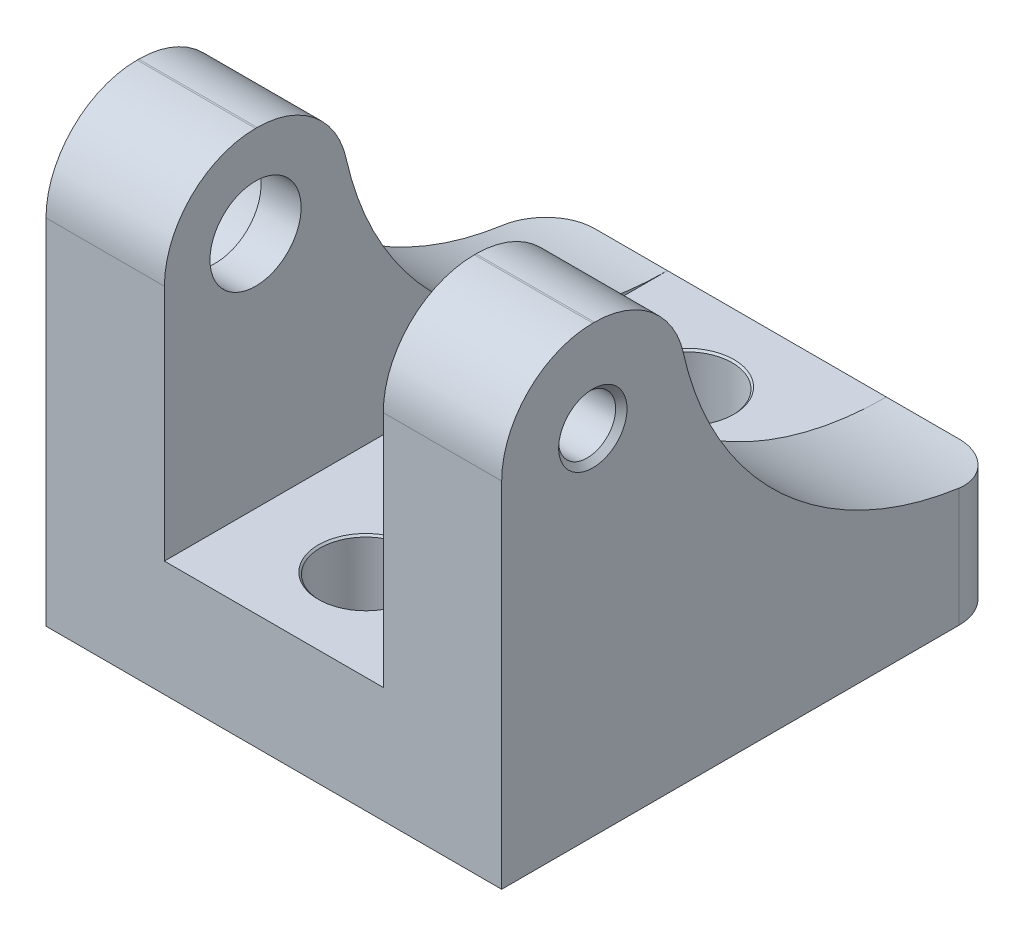
ISO-10303-21;
HEADER;
FILE_DESCRIPTION(('STEP AP214'),'2;1');
FILE_NAME('part.step','',(''),(''),'','','');
FILE_SCHEMA(('AUTOMOTIVE_DESIGN { 1 0 10303 214 1 1 1 1 }'));
ENDSEC;
DATA;
#1=APPLICATION_CONTEXT('core data for automotive mechanical design processes');
#2=APPLICATION_PROTOCOL_DEFINITION('international standard','automotive_design',2000,#1);
#3=PRODUCT_CONTEXT('',#1,'mechanical');
#4=PRODUCT('Part','Part','',(#3));
#5=PRODUCT_RELATED_PRODUCT_CATEGORY('part','',(#4));
#6=PRODUCT_DEFINITION_FORMATION('','',#4);
#7=PRODUCT_DEFINITION_CONTEXT('part definition',#1,'design');
#8=PRODUCT_DEFINITION('design','',#6,#7);
#9=PRODUCT_DEFINITION_SHAPE('','',#8);
#10=(LENGTH_UNIT() NAMED_UNIT(*) SI_UNIT(.MILLI.,.METRE.));
#11=(NAMED_UNIT(*) PLANE_ANGLE_UNIT() SI_UNIT($,.RADIAN.));
#12=(NAMED_UNIT(*) SI_UNIT($,.STERADIAN.) SOLID_ANGLE_UNIT());
#13=UNCERTAINTY_MEASURE_WITH_UNIT(LENGTH_MEASURE(1.E-05),#10,'distance_accuracy_value','');
#14=(GEOMETRIC_REPRESENTATION_CONTEXT(3) GLOBAL_UNCERTAINTY_ASSIGNED_CONTEXT((#13)) GLOBAL_UNIT_ASSIGNED_CONTEXT((#10,
#11,#12)) REPRESENTATION_CONTEXT('',''));
#15=CARTESIAN_POINT('',(0.,0.,0.));
#16=DIRECTION('',(0.,0.,1.));
#17=DIRECTION('',(1.,0.,0.));
#18=AXIS2_PLACEMENT_3D('',#15,#16,#17);
#19=CARTESIAN_POINT('',(0.,61.976,0.));
#20=DIRECTION('',(0.,-1.,0.));
#21=DIRECTION('',(0.,0.,-1.));
#22=AXIS2_PLACEMENT_3D('',#19,#20,#21);
#23=PLANE('',#22);
#24=DIRECTION('',(1.,0.,0.));
#25=VECTOR('',#24,1.);
#26=CARTESIAN_POINT('',(0.,61.976,-12.9316840832639));
#27=LINE('',#26,#25);
#28=CARTESIAN_POINT('',(63.5,61.976,-12.9316840832639));
#29=VERTEX_POINT('',#28);
#30=CARTESIAN_POINT('',(47.,61.976,-12.9316840832639));
#31=VERTEX_POINT('',#30);
#32=EDGE_CURVE('E352',#29,#31,#27,.F.);
#33=ORIENTED_EDGE('',*,*,#32,.T.);
#34=DIRECTION('',(0.,0.,1.));
#35=VECTOR('',#34,1.);
#36=CARTESIAN_POINT('',(47.,61.976,-70.104));
#37=LINE('',#36,#35);
#38=CARTESIAN_POINT('',(47.,61.976,-12.7));
#39=VERTEX_POINT('',#38);
#40=EDGE_CURVE('E228',#31,#39,#37,.T.);
#41=ORIENTED_EDGE('',*,*,#40,.T.);
#42=DIRECTION('',(1.,0.,0.));
#43=VECTOR('',#42,1.);
#44=CARTESIAN_POINT('',(0.,61.976,-12.7));
#45=LINE('',#44,#43);
#46=CARTESIAN_POINT('',(63.5,61.976,-12.7));
#47=VERTEX_POINT('',#46);
#48=EDGE_CURVE('E246',#39,#47,#45,.T.);
#49=ORIENTED_EDGE('',*,*,#48,.T.);
#50=DIRECTION('',(0.,0.,-1.));
#51=VECTOR('',#50,1.);
#52=CARTESIAN_POINT('',(63.5,61.976,0.));
#53=LINE('',#52,#51);
#54=EDGE_CURVE('E367',#47,#29,#53,.T.);
#55=ORIENTED_EDGE('',*,*,#54,.T.);
#56=EDGE_LOOP('',(#33,#41,#49,#55));
#57=FACE_BOUND('',#56,.T.);
#58=ADVANCED_FACE('F35',(#57),#23,.F.);
#59=CARTESIAN_POINT('',(0.,61.976,-70.104));
#60=DIRECTION('',(1.,0.,0.));
#61=DIRECTION('',(0.,0.,-1.));
#62=AXIS2_PLACEMENT_3D('',#59,#60,#61);
#63=CYLINDRICAL_SURFACE('',#62,45.8658920130401);
#64=DIRECTION('',(1.,0.,0.));
#65=VECTOR('',#64,1.);
#66=CARTESIAN_POINT('',(0.,16.1101079869599,-70.104));
#67=LINE('',#66,#65);
#68=CARTESIAN_POINT('',(47.,16.1101079869599,-70.104));
#69=VERTEX_POINT('',#68);
#70=CARTESIAN_POINT('',(57.15,16.1101079869599,-70.104));
#71=VERTEX_POINT('',#70);
#72=EDGE_CURVE('E60',#69,#71,#67,.T.);
#73=ORIENTED_EDGE('',*,*,#72,.F.);
#74=CARTESIAN_POINT('',(47.,61.976,-70.104));
#75=DIRECTION('',(1.,0.,0.));
#76=DIRECTION('',(0.,0.,-1.));
#77=AXIS2_PLACEMENT_3D('',#74,#75,#76);
#78=CIRCLE('',#77,45.8658920130401);
#79=CARTESIAN_POINT('',(47.,52.0299920328386,-25.3294874323682));
#80=VERTEX_POINT('',#79);
#81=EDGE_CURVE('E219',#69,#80,#78,.F.);
#82=ORIENTED_EDGE('',*,*,#81,.T.);
#83=DIRECTION('',(1.,0.,0.));
#84=VECTOR('',#83,1.);
#85=CARTESIAN_POINT('',(0.,52.0299920328386,-25.3294874323682));
#86=LINE('',#85,#84);
#87=CARTESIAN_POINT('',(63.5,52.0299920328386,-25.3294874323682));
#88=VERTEX_POINT('',#87);
#89=EDGE_CURVE('E362',#80,#88,#86,.T.);
#90=ORIENTED_EDGE('',*,*,#89,.T.);
#91=CARTESIAN_POINT('',(63.5,61.976,-70.104));
#92=DIRECTION('',(1.,0.,0.));
#93=DIRECTION('',(0.,0.,-1.));
#94=AXIS2_PLACEMENT_3D('',#91,#92,#93);
#95=CIRCLE('',#94,45.8658920130401);
#96=CARTESIAN_POINT('',(63.5,16.5518043532761,-63.754));
#97=VERTEX_POINT('',#96);
#98=EDGE_CURVE('E188',#88,#97,#95,.T.);
#99=ORIENTED_EDGE('',*,*,#98,.T.);
#100=CARTESIAN_POINT('',(63.5,16.5518043532761,-63.754));
#101=CARTESIAN_POINT('',(63.5000196025609,16.5270901487558,-63.9307165444268));
#102=CARTESIAN_POINT('',(63.4926238054073,16.5034268505947,-64.1075830488763));
#103=CARTESIAN_POINT('',(63.4630671968562,16.4583025677582,-64.4603628241222));
#104=CARTESIAN_POINT('',(63.4409061783909,16.4368416139733,-64.6362760815154));
#105=CARTESIAN_POINT('',(63.3819031150375,16.3962357443872,-64.9857833763753));
#106=CARTESIAN_POINT('',(63.3450701325067,16.3770894084255,-65.1593787772217));
#107=CARTESIAN_POINT('',(63.2569329279387,16.3411274965883,-65.5030975186416));
#108=CARTESIAN_POINT('',(63.2056291688241,16.3243118461794,-65.6732209700965));
#109=CARTESIAN_POINT('',(63.0888290420714,16.292979818058,-66.0088624311424));
#110=CARTESIAN_POINT('',(63.0233238728435,16.2784648759537,-66.1743775125002));
#111=CARTESIAN_POINT('',(62.878544882949,16.2516684250706,-66.499533963454));
#112=CARTESIAN_POINT('',(62.7992659818956,16.2393877438238,-66.6591731393231));
#113=CARTESIAN_POINT('',(62.627538892471,16.2169520177526,-66.9712621028462));
#114=CARTESIAN_POINT('',(62.5350968944456,16.206795979263,-67.1237152253546));
#115=CARTESIAN_POINT('',(62.3376596555954,16.1884427709255,-67.4203929982001));
#116=CARTESIAN_POINT('',(62.2326641605881,16.1802456407516,-67.5646174818366));
#117=CARTESIAN_POINT('',(62.0114221735617,16.1656560212587,-67.8430754093447));
#118=CARTESIAN_POINT('',(61.8952347984165,16.1592546804816,-67.9773553674312));
#119=CARTESIAN_POINT('',(61.6519899693174,16.1479909369384,-68.2357485432069));
#120=CARTESIAN_POINT('',(61.5249325483114,16.1431285295079,-68.3598617917099));
#121=CARTESIAN_POINT('',(61.2608140495119,16.134716525913,-68.5970590291766));
#122=CARTESIAN_POINT('',(61.1237505776319,16.1311672451733,-68.710140363381));
#123=CARTESIAN_POINT('',(60.8406192876178,16.1251531272757,-68.9244303576798));
#124=CARTESIAN_POINT('',(60.6945516240537,16.122688271508,-69.0256392214959));
#125=CARTESIAN_POINT('',(60.394063964283,16.1186118648673,-69.2157059508047));
#126=CARTESIAN_POINT('',(60.2396239143337,16.1170024724125,-69.3045321614144));
#127=CARTESIAN_POINT('',(59.92388314051,16.1144320608181,-69.468869962778));
#128=CARTESIAN_POINT('',(59.7625849016851,16.1134708089191,-69.544386326144));
#129=CARTESIAN_POINT('',(59.4342489934345,16.112001762078,-69.681592075002));
#130=CARTESIAN_POINT('',(59.2672127674326,16.1114938539495,-69.7432849089293));
#131=CARTESIAN_POINT('',(58.928615885181,16.1107656540308,-69.8524162414465));
#132=CARTESIAN_POINT('',(58.7570562542225,16.1105452976252,-69.8998579405451));
#133=CARTESIAN_POINT('',(58.3488043963675,16.1102056488348,-69.9944697175828));
#134=CARTESIAN_POINT('',(58.1106543511925,16.1101502016966,-70.035538529829));
#135=CARTESIAN_POINT('',(57.7513852036139,16.1101144761882,-70.0766087416445));
#136=CARTESIAN_POINT('',(57.6313422431885,16.110110466428,-70.0868766356861));
#137=CARTESIAN_POINT('',(57.3908767594374,16.1101078097517,-70.1005712905643));
#138=CARTESIAN_POINT('',(57.2704542687353,16.1101091623866,-70.103998624157));
#139=CARTESIAN_POINT('',(57.15,16.1101079869599,-70.104));
#140=B_SPLINE_CURVE_WITH_KNOTS('',3,(#100,#101,#102,#103,#104,#105,#106,#107,#108,#109,#110,
#111,#112,#113,#114,#115,#116,#117,#118,#119,#120,#121,#122,#123,#124,#125,#126,#127,#128,#129,
#130,#131,#132,#133,#134,#135,#136,#137,#138,#139),.UNSPECIFIED.,.F.,.F.,(4,2,2,2,2,2,2,2,2,2,2,
2,2,2,2,2,2,2,2,4),(0.,0.535157201483708,1.07032190818259,1.60515657371647,2.13997413173911,
2.67512410538596,3.21047188768451,3.74556873288179,4.28067641453154,4.81309824959147,
5.34551847089816,5.87806650130234,6.41060539229192,6.94448162891428,7.4781660383158,
8.011717165533,8.54514837851854,9.26835569273905,9.62963658731783,9.99088723078644),.UNSPECIFIED.);
#141=EDGE_CURVE('E11',#97,#71,#140,.T.);
#142=ORIENTED_EDGE('',*,*,#141,.T.);
#143=EDGE_LOOP('',(#73,#82,#90,#99,#142));
#144=FACE_BOUND('',#143,.T.);
#145=ADVANCED_FACE('F294',(#144),#63,.F.);
#146=CARTESIAN_POINT('',(0.,49.276,-12.9316840832639));
#147=DIRECTION('',(1.,0.,0.));
#148=DIRECTION('',(0.,0.,-1.));
#149=AXIS2_PLACEMENT_3D('',#146,#147,#148);
#150=CYLINDRICAL_SURFACE('',#149,12.7);
#151=CARTESIAN_POINT('',(47.,49.276,-12.9316840832639));
#152=DIRECTION('',(1.,0.,0.));
#153=DIRECTION('',(0.,0.,-1.));
#154=AXIS2_PLACEMENT_3D('',#151,#152,#153);
#155=CIRCLE('',#154,12.7);
#156=EDGE_CURVE('E222',#31,#80,#155,.F.);
#157=ORIENTED_EDGE('',*,*,#156,.F.);
#158=ORIENTED_EDGE('',*,*,#32,.F.);
#159=CARTESIAN_POINT('',(63.5,49.276,-12.9316840832639));
#160=DIRECTION('',(-1.,0.,0.));
#161=DIRECTION('',(0.,0.,1.));
#162=AXIS2_PLACEMENT_3D('',#159,#160,#161);
#163=CIRCLE('',#162,12.7);
#164=EDGE_CURVE('E257',#88,#29,#163,.F.);
#165=ORIENTED_EDGE('',*,*,#164,.F.);
#166=ORIENTED_EDGE('',*,*,#89,.F.);
#167=EDGE_LOOP('',(#157,#158,#165,#166));
#168=FACE_BOUND('',#167,.T.);
#169=ADVANCED_FACE('F327',(#168),#150,.T.);
#170=CARTESIAN_POINT('',(0.,49.276,-12.7));
#171=DIRECTION('',(1.,0.,0.));
#172=DIRECTION('',(0.,0.,-1.));
#173=AXIS2_PLACEMENT_3D('',#170,#171,#172);
#174=CYLINDRICAL_SURFACE('',#173,12.7);
#175=CARTESIAN_POINT('',(47.,49.276,-12.7));
#176=DIRECTION('',(1.,0.,0.));
#177=DIRECTION('',(0.,0.,-1.));
#178=AXIS2_PLACEMENT_3D('',#175,#176,#177);
#179=CIRCLE('',#178,12.7);
#180=CARTESIAN_POINT('',(47.,49.276,0.));
#181=VERTEX_POINT('',#180);
#182=EDGE_CURVE('E224',#181,#39,#179,.F.);
#183=ORIENTED_EDGE('',*,*,#182,.F.);
#184=DIRECTION('',(1.,0.,0.));
#185=VECTOR('',#184,1.);
#186=CARTESIAN_POINT('',(0.,49.276,0.));
#187=LINE('',#186,#185);
#188=CARTESIAN_POINT('',(63.5,49.276,0.));
#189=VERTEX_POINT('',#188);
#190=EDGE_CURVE('E245',#189,#181,#187,.F.);
#191=ORIENTED_EDGE('',*,*,#190,.F.);
#192=CARTESIAN_POINT('',(63.5,49.276,-12.7));
#193=DIRECTION('',(-1.,0.,0.));
#194=DIRECTION('',(0.,0.,1.));
#195=AXIS2_PLACEMENT_3D('',#192,#193,#194);
#196=CIRCLE('',#195,12.7);
#197=EDGE_CURVE('E363',#47,#189,#196,.F.);
#198=ORIENTED_EDGE('',*,*,#197,.F.);
#199=ORIENTED_EDGE('',*,*,#48,.F.);
#200=EDGE_LOOP('',(#183,#191,#198,#199));
#201=FACE_BOUND('',#200,.T.);
#202=ADVANCED_FACE('F243',(#201),#174,.T.);
#203=CARTESIAN_POINT('',(0.,61.976,0.));
#204=DIRECTION('',(1.,0.,0.));
#205=DIRECTION('',(0.,0.,-1.));
#206=AXIS2_PLACEMENT_3D('',#203,#204,#205);
#207=PLANE('',#206);
#208=CARTESIAN_POINT('',(0.,49.276,-12.7));
#209=DIRECTION('',(-1.,0.,0.));
#210=DIRECTION('',(0.,0.,1.));
#211=AXIS2_PLACEMENT_3D('',#208,#209,#210);
#212=CIRCLE('',#211,10.414);
#213=CARTESIAN_POINT('',(0.,49.276,-2.286));
#214=VERTEX_POINT('',#213);
#215=EDGE_CURVE('E203',#214,#214,#212,.T.);
#216=ORIENTED_EDGE('',*,*,#215,.F.);
#217=EDGE_LOOP('',(#216));
#218=FACE_BOUND('',#217,.T.);
#219=CARTESIAN_POINT('',(0.,61.976,-70.104));
#220=DIRECTION('',(1.,0.,0.));
#221=DIRECTION('',(0.,0.,-1.));
#222=AXIS2_PLACEMENT_3D('',#219,#220,#221);
#223=CIRCLE('',#222,45.8658920130401);
#224=CARTESIAN_POINT('',(0.,52.0299920328386,-25.3294874323682));
#225=VERTEX_POINT('',#224);
#226=CARTESIAN_POINT('',(0.,16.5518043532761,-63.754));
#227=VERTEX_POINT('',#226);
#228=EDGE_CURVE('E186',#225,#227,#223,.T.);
#229=ORIENTED_EDGE('',*,*,#228,.T.);
#230=DIRECTION('',(0.,-1.,0.));
#231=VECTOR('',#230,1.);
#232=CARTESIAN_POINT('',(0.,61.976,-63.754));
#233=LINE('',#232,#231);
#234=CARTESIAN_POINT('',(0.,0.,-63.754));
#235=VERTEX_POINT('',#234);
#236=EDGE_CURVE('E269',#227,#235,#233,.T.);
#237=ORIENTED_EDGE('',*,*,#236,.T.);
#238=DIRECTION('',(0.,0.,1.));
#239=VECTOR('',#238,1.);
#240=CARTESIAN_POINT('',(0.,0.,0.));
#241=LINE('',#240,#239);
#242=CARTESIAN_POINT('',(0.,0.,0.));
#243=VERTEX_POINT('',#242);
#244=EDGE_CURVE('E181',#235,#243,#241,.T.);
#245=ORIENTED_EDGE('',*,*,#244,.T.);
#246=DIRECTION('',(0.,-1.,0.));
#247=VECTOR('',#246,1.);
#248=CARTESIAN_POINT('',(0.,61.976,0.));
#249=LINE('',#248,#247);
#250=CARTESIAN_POINT('',(0.,49.276,0.));
#251=VERTEX_POINT('',#250);
#252=EDGE_CURVE('E354',#251,#243,#249,.T.);
#253=ORIENTED_EDGE('',*,*,#252,.F.);
#254=CARTESIAN_POINT('',(0.,49.276,-12.7));
#255=DIRECTION('',(1.,0.,0.));
#256=DIRECTION('',(0.,0.,-1.));
#257=AXIS2_PLACEMENT_3D('',#254,#255,#256);
#258=CIRCLE('',#257,12.7);
#259=CARTESIAN_POINT('',(0.,61.976,-12.7));
#260=VERTEX_POINT('',#259);
#261=EDGE_CURVE('E358',#251,#260,#258,.F.);
#262=ORIENTED_EDGE('',*,*,#261,.T.);
#263=DIRECTION('',(0.,0.,1.));
#264=VECTOR('',#263,1.);
#265=CARTESIAN_POINT('',(0.,61.976,0.));
#266=LINE('',#265,#264);
#267=CARTESIAN_POINT('',(0.,61.976,-12.9316840832639));
#268=VERTEX_POINT('',#267);
#269=EDGE_CURVE('E346',#268,#260,#266,.T.);
#270=ORIENTED_EDGE('',*,*,#269,.F.);
#271=CARTESIAN_POINT('',(0.,49.276,-12.9316840832639));
#272=DIRECTION('',(1.,0.,0.));
#273=DIRECTION('',(0.,0.,-1.));
#274=AXIS2_PLACEMENT_3D('',#271,#272,#273);
#275=CIRCLE('',#274,12.7);
#276=EDGE_CURVE('E360',#268,#225,#275,.F.);
#277=ORIENTED_EDGE('',*,*,#276,.T.);
#278=EDGE_LOOP('',(#229,#237,#245,#253,#262,#270,#277));
#279=FACE_BOUND('',#278,.T.);
#280=ADVANCED_FACE('F389',(#218,#279),#207,.F.);
#281=CARTESIAN_POINT('',(0.,61.976,0.));
#282=DIRECTION('',(0.,0.,-1.));
#283=DIRECTION('',(-1.,0.,0.));
#284=AXIS2_PLACEMENT_3D('',#281,#282,#283);
#285=PLANE('',#284);
#286=ORIENTED_EDGE('',*,*,#190,.T.);
#287=DIRECTION('',(0.,1.,0.));
#288=VECTOR('',#287,1.);
#289=CARTESIAN_POINT('',(47.,16.1101079869599,0.));
#290=LINE('',#289,#288);
#291=CARTESIAN_POINT('',(47.,16.1101079869599,0.));
#292=VERTEX_POINT('',#291);
#293=EDGE_CURVE('E164',#292,#181,#290,.T.);
#294=ORIENTED_EDGE('',*,*,#293,.F.);
#295=DIRECTION('',(-1.,0.,0.));
#296=VECTOR('',#295,1.);
#297=CARTESIAN_POINT('',(46.228,16.1101079869599,0.));
#298=LINE('',#297,#296);
#299=CARTESIAN_POINT('',(16.5,16.1101079869599,0.));
#300=VERTEX_POINT('',#299);
#301=EDGE_CURVE('E193',#292,#300,#298,.T.);
#302=ORIENTED_EDGE('',*,*,#301,.T.);
#303=DIRECTION('',(0.,-1.,0.));
#304=VECTOR('',#303,1.);
#305=CARTESIAN_POINT('',(16.5,16.1101079869599,0.));
#306=LINE('',#305,#304);
#307=CARTESIAN_POINT('',(16.5,49.276,0.));
#308=VERTEX_POINT('',#307);
#309=EDGE_CURVE('E163',#308,#300,#306,.T.);
#310=ORIENTED_EDGE('',*,*,#309,.F.);
#311=EDGE_CURVE('E252',#308,#251,#187,.F.);
#312=ORIENTED_EDGE('',*,*,#311,.T.);
#313=ORIENTED_EDGE('',*,*,#252,.T.);
#314=DIRECTION('',(1.,0.,0.));
#315=VECTOR('',#314,1.);
#316=CARTESIAN_POINT('',(0.,0.,0.));
#317=LINE('',#316,#315);
#318=CARTESIAN_POINT('',(63.5,0.,0.));
#319=VERTEX_POINT('',#318);
#320=EDGE_CURVE('E182',#243,#319,#317,.T.);
#321=ORIENTED_EDGE('',*,*,#320,.T.);
#322=DIRECTION('',(0.,-1.,0.));
#323=VECTOR('',#322,1.);
#324=CARTESIAN_POINT('',(63.5,61.976,0.));
#325=LINE('',#324,#323);
#326=EDGE_CURVE('E250',#189,#319,#325,.T.);
#327=ORIENTED_EDGE('',*,*,#326,.F.);
#328=EDGE_LOOP('',(#286,#294,#302,#310,#312,#313,#321,#327));
#329=FACE_BOUND('',#328,.T.);
#330=ADVANCED_FACE('F248',(#329),#285,.F.);
#331=CARTESIAN_POINT('',(63.5,61.976,0.));
#332=DIRECTION('',(-1.,0.,0.));
#333=DIRECTION('',(0.,0.,1.));
#334=AXIS2_PLACEMENT_3D('',#331,#332,#333);
#335=PLANE('',#334);
#336=CARTESIAN_POINT('',(63.5,49.276,-12.7));
#337=DIRECTION('',(1.,0.,0.));
#338=DIRECTION('',(0.,0.,-1.));
#339=AXIS2_PLACEMENT_3D('',#336,#337,#338);
#340=CIRCLE('',#339,4.7625);
#341=CARTESIAN_POINT('',(63.5,49.276,-17.4625));
#342=VERTEX_POINT('',#341);
#343=EDGE_CURVE('E174',#342,#342,#340,.T.);
#344=ORIENTED_EDGE('',*,*,#343,.F.);
#345=EDGE_LOOP('',(#344));
#346=FACE_BOUND('',#345,.T.);
#347=DIRECTION('',(0.,0.,-1.));
#348=VECTOR('',#347,1.);
#349=CARTESIAN_POINT('',(63.5,0.,0.));
#350=LINE('',#349,#348);
#351=CARTESIAN_POINT('',(63.5,0.,-63.754));
#352=VERTEX_POINT('',#351);
#353=EDGE_CURVE('E381',#319,#352,#350,.T.);
#354=ORIENTED_EDGE('',*,*,#353,.T.);
#355=DIRECTION('',(0.,-1.,0.));
#356=VECTOR('',#355,1.);
#357=CARTESIAN_POINT('',(63.5,61.976,-63.754));
#358=LINE('',#357,#356);
#359=EDGE_CURVE('E45',#352,#97,#358,.F.);
#360=ORIENTED_EDGE('',*,*,#359,.T.);
#361=ORIENTED_EDGE('',*,*,#98,.F.);
#362=ORIENTED_EDGE('',*,*,#164,.T.);
#363=ORIENTED_EDGE('',*,*,#54,.F.);
#364=ORIENTED_EDGE('',*,*,#197,.T.);
#365=ORIENTED_EDGE('',*,*,#326,.T.);
#366=EDGE_LOOP('',(#354,#360,#361,#362,#363,#364,#365));
#367=FACE_BOUND('',#366,.T.);
#368=ADVANCED_FACE('F337',(#346,#367),#335,.F.);
#369=CARTESIAN_POINT('',(0.,61.976,-70.104));
#370=DIRECTION('',(0.,0.,1.));
#371=DIRECTION('',(1.,0.,0.));
#372=AXIS2_PLACEMENT_3D('',#369,#370,#371);
#373=PLANE('',#372);
#374=DIRECTION('',(-1.,0.,0.));
#375=VECTOR('',#374,1.);
#376=CARTESIAN_POINT('',(0.,0.,-70.104));
#377=LINE('',#376,#375);
#378=CARTESIAN_POINT('',(57.15,0.,-70.104));
#379=VERTEX_POINT('',#378);
#380=CARTESIAN_POINT('',(6.35,0.,-70.104));
#381=VERTEX_POINT('',#380);
#382=EDGE_CURVE('E377',#379,#381,#377,.T.);
#383=ORIENTED_EDGE('',*,*,#382,.T.);
#384=DIRECTION('',(0.,-1.,0.));
#385=VECTOR('',#384,1.);
#386=CARTESIAN_POINT('',(6.35,61.976,-70.104));
#387=LINE('',#386,#385);
#388=CARTESIAN_POINT('',(6.35,16.1101079869599,-70.104));
#389=VERTEX_POINT('',#388);
#390=EDGE_CURVE('E180',#381,#389,#387,.F.);
#391=ORIENTED_EDGE('',*,*,#390,.T.);
#392=CARTESIAN_POINT('',(16.5,16.1101079869599,-70.104));
#393=VERTEX_POINT('',#392);
#394=EDGE_CURVE('E154',#389,#393,#67,.T.);
#395=ORIENTED_EDGE('',*,*,#394,.T.);
#396=EDGE_CURVE('E147',#393,#69,#67,.T.);
#397=ORIENTED_EDGE('',*,*,#396,.T.);
#398=ORIENTED_EDGE('',*,*,#72,.T.);
#399=DIRECTION('',(0.,-1.,0.));
#400=VECTOR('',#399,1.);
#401=CARTESIAN_POINT('',(57.15,61.976,-70.104));
#402=LINE('',#401,#400);
#403=EDGE_CURVE('E275',#71,#379,#402,.T.);
#404=ORIENTED_EDGE('',*,*,#403,.T.);
#405=EDGE_LOOP('',(#383,#391,#395,#397,#398,#404));
#406=FACE_BOUND('',#405,.T.);
#407=ADVANCED_FACE('F178',(#406),#373,.F.);
#408=CARTESIAN_POINT('',(16.5,61.976,-12.7));
#409=VERTEX_POINT('',#408);
#410=EDGE_CURVE('E343',#260,#409,#45,.T.);
#411=ORIENTED_EDGE('',*,*,#410,.T.);
#412=DIRECTION('',(0.,0.,1.));
#413=VECTOR('',#412,1.);
#414=CARTESIAN_POINT('',(16.5,61.976,-70.104));
#415=LINE('',#414,#413);
#416=CARTESIAN_POINT('',(16.5,61.976,-12.9316840832639));
#417=VERTEX_POINT('',#416);
#418=EDGE_CURVE('E231',#417,#409,#415,.T.);
#419=ORIENTED_EDGE('',*,*,#418,.F.);
#420=EDGE_CURVE('E350',#417,#268,#27,.F.);
#421=ORIENTED_EDGE('',*,*,#420,.T.);
#422=ORIENTED_EDGE('',*,*,#269,.T.);
#423=EDGE_LOOP('',(#411,#419,#421,#422));
#424=FACE_BOUND('',#423,.T.);
#425=ADVANCED_FACE('F296',(#424),#23,.F.);
#426=CARTESIAN_POINT('',(0.,0.,0.));
#427=DIRECTION('',(0.,-1.,0.));
#428=DIRECTION('',(0.,0.,-1.));
#429=AXIS2_PLACEMENT_3D('',#426,#427,#428);
#430=PLANE('',#429);
#431=CARTESIAN_POINT('',(31.8647521625244,0.,-12.6994815619062));
#432=DIRECTION('',(0.,1.,0.));
#433=DIRECTION('',(0.,0.,1.));
#434=AXIS2_PLACEMENT_3D('',#431,#432,#433);
#435=CIRCLE('',#434,6.35);
#436=CARTESIAN_POINT('',(31.8647521625244,0.,-6.34948156190621));
#437=VERTEX_POINT('',#436);
#438=EDGE_CURVE('E199',#437,#437,#435,.T.);
#439=ORIENTED_EDGE('',*,*,#438,.T.);
#440=EDGE_LOOP('',(#439));
#441=FACE_BOUND('',#440,.T.);
#442=CARTESIAN_POINT('',(31.8647568471166,0.,-57.404));
#443=DIRECTION('',(0.,1.,0.));
#444=DIRECTION('',(0.,0.,1.));
#445=AXIS2_PLACEMENT_3D('',#442,#443,#444);
#446=CIRCLE('',#445,6.35);
#447=CARTESIAN_POINT('',(31.8647568471166,0.,-51.054));
#448=VERTEX_POINT('',#447);
#449=EDGE_CURVE('E196',#448,#448,#446,.T.);
#450=ORIENTED_EDGE('',*,*,#449,.T.);
#451=EDGE_LOOP('',(#450));
#452=FACE_BOUND('',#451,.T.);
#453=ORIENTED_EDGE('',*,*,#244,.F.);
#454=CARTESIAN_POINT('',(6.35,0.,-63.754));
#455=DIRECTION('',(0.,-1.,0.));
#456=DIRECTION('',(0.,0.,-1.));
#457=AXIS2_PLACEMENT_3D('',#454,#455,#456);
#458=CIRCLE('',#457,6.35);
#459=EDGE_CURVE('E273',#235,#381,#458,.T.);
#460=ORIENTED_EDGE('',*,*,#459,.T.);
#461=ORIENTED_EDGE('',*,*,#382,.F.);
#462=CARTESIAN_POINT('',(57.15,0.,-63.754));
#463=DIRECTION('',(0.,-1.,0.));
#464=DIRECTION('',(0.,0.,-1.));
#465=AXIS2_PLACEMENT_3D('',#462,#463,#464);
#466=CIRCLE('',#465,6.35);
#467=EDGE_CURVE('E271',#379,#352,#466,.T.);
#468=ORIENTED_EDGE('',*,*,#467,.T.);
#469=ORIENTED_EDGE('',*,*,#353,.F.);
#470=ORIENTED_EDGE('',*,*,#320,.F.);
#471=EDGE_LOOP('',(#453,#460,#461,#468,#469,#470));
#472=FACE_BOUND('',#471,.T.);
#473=ADVANCED_FACE('F293',(#441,#452,#472),#430,.T.);
#474=CARTESIAN_POINT('',(16.5,52.0299920328386,-25.3294874323682));
#475=VERTEX_POINT('',#474);
#476=EDGE_CURVE('E173',#225,#475,#86,.T.);
#477=ORIENTED_EDGE('',*,*,#476,.T.);
#478=CARTESIAN_POINT('',(16.5,61.976,-70.104));
#479=DIRECTION('',(-1.,0.,0.));
#480=DIRECTION('',(0.,0.,1.));
#481=AXIS2_PLACEMENT_3D('',#478,#479,#480);
#482=CIRCLE('',#481,45.8658920130401);
#483=EDGE_CURVE('E160',#475,#393,#482,.F.);
#484=ORIENTED_EDGE('',*,*,#483,.T.);
#485=ORIENTED_EDGE('',*,*,#394,.F.);
#486=CARTESIAN_POINT('',(6.35,16.1101079869599,-70.104));
#487=CARTESIAN_POINT('',(6.17143340419776,16.1101158403652,-70.1040191907411));
#488=CARTESIAN_POINT('',(5.99286956029038,16.1101082335894,-70.0964686724448));
#489=CARTESIAN_POINT('',(5.63701883242709,16.1101188585174,-70.0663668126261));
#490=CARTESIAN_POINT('',(5.45973188864823,16.1101370890027,-70.0438161785434));
#491=CARTESIAN_POINT('',(5.10781647973872,16.1102560943343,-69.9838743140426));
#492=CARTESIAN_POINT('',(4.93318618684661,16.1103568095478,-69.9464938149751));
#493=CARTESIAN_POINT('',(4.58769505826889,16.1107503129259,-69.8571641154676));
#494=CARTESIAN_POINT('',(4.41683417654171,16.111043098743,-69.8052150930815));
#495=CARTESIAN_POINT('',(4.08004077664374,16.1119648015263,-69.6870971460392));
#496=CARTESIAN_POINT('',(3.91410982499498,16.1125938241536,-69.6209237553429));
#497=CARTESIAN_POINT('',(3.58835271465941,16.1143656069596,-69.4748113275943));
#498=CARTESIAN_POINT('',(3.42852882836065,16.1155085563849,-69.3948672263591));
#499=CARTESIAN_POINT('',(3.11624662406961,16.1185108497464,-69.2218325523369));
#500=CARTESIAN_POINT('',(2.96378564068105,16.1203699322188,-69.1287467854863));
#501=CARTESIAN_POINT('',(2.66725142587712,16.1250260642065,-68.9300713366135));
#502=CARTESIAN_POINT('',(2.52317835091688,16.127823131211,-68.8244814214694));
#503=CARTESIAN_POINT('',(2.24456630290562,16.1345841866162,-68.6016497101737));
#504=CARTESIAN_POINT('',(2.11001962575164,16.1385472184008,-68.4844175179612));
#505=CARTESIAN_POINT('',(1.85129105825914,16.1478735779224,-68.2390753629765));
#506=CARTESIAN_POINT('',(1.72710916806736,16.1532369056792,-68.1109654000502));
#507=CARTESIAN_POINT('',(1.4899804593766,16.1655893212749,-67.8447805044242));
#508=CARTESIAN_POINT('',(1.37703510936985,16.172578621213,-67.7067042733009));
#509=CARTESIAN_POINT('',(1.16320332734908,16.1883899923726,-67.4216136319634));
#510=CARTESIAN_POINT('',(1.06231660705784,16.1972120197665,-67.2745994355498));
#511=CARTESIAN_POINT('',(0.87359307636122,16.2168410093684,-66.9731601999628));
#512=CARTESIAN_POINT('',(0.785718147456943,16.2276419575541,-66.818758634334));
#513=CARTESIAN_POINT('',(0.623295263267338,16.2513870642085,-66.5033295867948));
#514=CARTESIAN_POINT('',(0.548742461806995,16.2643304400146,-66.3423045406302));
#515=CARTESIAN_POINT('',(0.413435858209337,16.2924661864376,-66.014771888169));
#516=CARTESIAN_POINT('',(0.352679796913797,16.3076581881774,-65.8482651845907));
#517=CARTESIAN_POINT('',(0.245356407007227,16.3403407038035,-65.5110296976462));
#518=CARTESIAN_POINT('',(0.198785886142605,16.3578306992892,-65.3403018735466));
#519=CARTESIAN_POINT('',(0.106376276742448,16.401631910808,-64.935684419967));
#520=CARTESIAN_POINT('',(0.0664420554956736,16.4288937448771,-64.7005078682984));
#521=CARTESIAN_POINT('',(0.0265549539477495,16.4727933008286,-64.3461845911328));
#522=CARTESIAN_POINT('',(0.0165949447495336,16.487918861869,-64.2278798226549));
#523=CARTESIAN_POINT('',(0.00331847946653698,16.5191411253874,-63.9910381989347));
#524=CARTESIAN_POINT('',(1.33377578786717E-06,16.5352377268813,-63.872501369062));
#525=CARTESIAN_POINT('',(0.,16.5518043532761,-63.754));
#526=B_SPLINE_CURVE_WITH_KNOTS('',3,(#486,#487,#488,#489,#490,#491,#492,#493,#494,#495,#496,
#497,#498,#499,#500,#501,#502,#503,#504,#505,#506,#507,#508,#509,#510,#511,#512,#513,#514,#515,
#516,#517,#518,#519,#520,#521,#522,#523,#524,#525),.UNSPECIFIED.,.F.,.F.,(4,2,2,2,2,2,2,2,2,2,2,
2,2,2,2,2,2,2,2,4),(0.,0.535536345243149,1.07104743516255,1.60617171740093,2.14128945972762,
2.6765754595844,3.21205873293727,3.74734668369617,4.28264461569515,4.81750458127893,
5.35236455443487,5.88729433633551,6.42221132748495,6.95552886501347,7.48865200153547,
8.02168777833508,8.55460351426441,9.27314191260687,9.63203318500004,9.99088719840156),.UNSPECIFIED.);
#527=EDGE_CURVE('E278',#389,#227,#526,.T.);
#528=ORIENTED_EDGE('',*,*,#527,.T.);
#529=ORIENTED_EDGE('',*,*,#228,.F.);
#530=EDGE_LOOP('',(#477,#484,#485,#528,#529));
#531=FACE_BOUND('',#530,.T.);
#532=ADVANCED_FACE('F169',(#531),#63,.F.);
#533=CARTESIAN_POINT('',(16.5,49.276,-12.9316840832639));
#534=DIRECTION('',(-1.,0.,0.));
#535=DIRECTION('',(0.,0.,1.));
#536=AXIS2_PLACEMENT_3D('',#533,#534,#535);
#537=CIRCLE('',#536,12.7);
#538=EDGE_CURVE('E175',#475,#417,#537,.F.);
#539=ORIENTED_EDGE('',*,*,#538,.F.);
#540=ORIENTED_EDGE('',*,*,#476,.F.);
#541=ORIENTED_EDGE('',*,*,#276,.F.);
#542=ORIENTED_EDGE('',*,*,#420,.F.);
#543=EDGE_LOOP('',(#539,#540,#541,#542));
#544=FACE_BOUND('',#543,.T.);
#545=ADVANCED_FACE('F292',(#544),#150,.T.);
#546=CARTESIAN_POINT('',(16.5,49.276,-12.7));
#547=DIRECTION('',(-1.,0.,0.));
#548=DIRECTION('',(0.,0.,1.));
#549=AXIS2_PLACEMENT_3D('',#546,#547,#548);
#550=CIRCLE('',#549,12.7);
#551=EDGE_CURVE('E217',#409,#308,#550,.F.);
#552=ORIENTED_EDGE('',*,*,#551,.F.);
#553=ORIENTED_EDGE('',*,*,#410,.F.);
#554=ORIENTED_EDGE('',*,*,#261,.F.);
#555=ORIENTED_EDGE('',*,*,#311,.F.);
#556=EDGE_LOOP('',(#552,#553,#554,#555));
#557=FACE_BOUND('',#556,.T.);
#558=ADVANCED_FACE('F393',(#557),#174,.T.);
#559=CARTESIAN_POINT('',(46.228,16.1101079869599,0.));
#560=DIRECTION('',(0.,-1.,0.));
#561=DIRECTION('',(0.,0.,-1.));
#562=AXIS2_PLACEMENT_3D('',#559,#560,#561);
#563=PLANE('',#562);
#564=CARTESIAN_POINT('',(31.8647521625244,16.1101079869599,-12.6994815619062));
#565=DIRECTION('',(0.,-1.,0.));
#566=DIRECTION('',(0.,0.,-1.));
#567=AXIS2_PLACEMENT_3D('',#564,#565,#566);
#568=CIRCLE('',#567,6.60399999999998);
#569=CARTESIAN_POINT('',(31.8647521625244,16.1101079869599,-19.3034815619062));
#570=VERTEX_POINT('',#569);
#571=EDGE_CURVE('E263',#570,#570,#568,.T.);
#572=ORIENTED_EDGE('',*,*,#571,.T.);
#573=EDGE_LOOP('',(#572));
#574=FACE_BOUND('',#573,.T.);
#575=CARTESIAN_POINT('',(31.8647568471166,16.1101079869599,-57.404));
#576=DIRECTION('',(0.,-1.,0.));
#577=DIRECTION('',(0.,0.,-1.));
#578=AXIS2_PLACEMENT_3D('',#575,#576,#577);
#579=CIRCLE('',#578,6.60399999999998);
#580=CARTESIAN_POINT('',(31.8647568471166,16.1101079869599,-64.008));
#581=VERTEX_POINT('',#580);
#582=EDGE_CURVE('E255',#581,#581,#579,.T.);
#583=ORIENTED_EDGE('',*,*,#582,.T.);
#584=EDGE_LOOP('',(#583));
#585=FACE_BOUND('',#584,.T.);
#586=ORIENTED_EDGE('',*,*,#396,.F.);
#587=DIRECTION('',(0.,0.,1.));
#588=VECTOR('',#587,1.);
#589=CARTESIAN_POINT('',(16.5,16.1101079869599,-70.104));
#590=LINE('',#589,#588);
#591=EDGE_CURVE('E150',#393,#300,#590,.T.);
#592=ORIENTED_EDGE('',*,*,#591,.T.);
#593=ORIENTED_EDGE('',*,*,#301,.F.);
#594=DIRECTION('',(0.,0.,1.));
#595=VECTOR('',#594,1.);
#596=CARTESIAN_POINT('',(47.,16.1101079869599,-70.104));
#597=LINE('',#596,#595);
#598=EDGE_CURVE('E152',#69,#292,#597,.T.);
#599=ORIENTED_EDGE('',*,*,#598,.F.);
#600=EDGE_LOOP('',(#586,#592,#593,#599));
#601=FACE_BOUND('',#600,.T.);
#602=ADVANCED_FACE('F149',(#574,#585,#601),#563,.F.);
#603=CARTESIAN_POINT('',(31.8647568471166,0.,-57.404));
#604=DIRECTION('',(0.,1.,0.));
#605=DIRECTION('',(0.,0.,1.));
#606=AXIS2_PLACEMENT_3D('',#603,#604,#605);
#607=CYLINDRICAL_SURFACE('',#606,6.35);
#608=CARTESIAN_POINT('',(31.8647568471166,15.8561079869599,-57.404));
#609=DIRECTION('',(0.,-1.,0.));
#610=DIRECTION('',(0.,0.,-1.));
#611=AXIS2_PLACEMENT_3D('',#608,#609,#610);
#612=CIRCLE('',#611,6.35);
#613=CARTESIAN_POINT('',(31.8647568471166,15.8561079869599,-63.754));
#614=VERTEX_POINT('',#613);
#615=EDGE_CURVE('E266',#614,#614,#612,.F.);
#616=ORIENTED_EDGE('',*,*,#615,.T.);
#617=EDGE_LOOP('',(#616));
#618=FACE_BOUND('',#617,.T.);
#619=ORIENTED_EDGE('',*,*,#449,.F.);
#620=EDGE_LOOP('',(#619));
#621=FACE_BOUND('',#620,.T.);
#622=ADVANCED_FACE('F400',(#618,#621),#607,.F.);
#623=CARTESIAN_POINT('',(31.8647521625244,0.,-12.6994815619062));
#624=DIRECTION('',(0.,1.,0.));
#625=DIRECTION('',(0.,0.,1.));
#626=AXIS2_PLACEMENT_3D('',#623,#624,#625);
#627=CYLINDRICAL_SURFACE('',#626,6.35);
#628=CARTESIAN_POINT('',(31.8647521625244,15.8561079869599,-12.6994815619062));
#629=DIRECTION('',(0.,-1.,0.));
#630=DIRECTION('',(0.,0.,-1.));
#631=AXIS2_PLACEMENT_3D('',#628,#629,#630);
#632=CIRCLE('',#631,6.35);
#633=CARTESIAN_POINT('',(31.8647521625244,15.8561079869599,-19.0494815619062));
#634=VERTEX_POINT('',#633);
#635=EDGE_CURVE('E251',#634,#634,#632,.F.);
#636=ORIENTED_EDGE('',*,*,#635,.T.);
#637=EDGE_LOOP('',(#636));
#638=FACE_BOUND('',#637,.T.);
#639=ORIENTED_EDGE('',*,*,#438,.F.);
#640=EDGE_LOOP('',(#639));
#641=FACE_BOUND('',#640,.T.);
#642=ADVANCED_FACE('F465',(#638,#641),#627,.F.);
#643=CARTESIAN_POINT('',(31.8647521625244,15.8561079869599,-12.6994815619062));
#644=DIRECTION('',(0.,1.,0.));
#645=DIRECTION('',(0.,0.,1.));
#646=AXIS2_PLACEMENT_3D('',#643,#644,#645);
#647=CONICAL_SURFACE('',#646,6.35,0.78539816339746);
#648=ORIENTED_EDGE('',*,*,#571,.F.);
#649=EDGE_LOOP('',(#648));
#650=FACE_BOUND('',#649,.T.);
#651=ORIENTED_EDGE('',*,*,#635,.F.);
#652=EDGE_LOOP('',(#651));
#653=FACE_BOUND('',#652,.T.);
#654=ADVANCED_FACE('F472',(#650,#653),#647,.F.);
#655=CARTESIAN_POINT('',(31.8647568471166,15.8561079869599,-57.404));
#656=DIRECTION('',(0.,1.,0.));
#657=DIRECTION('',(0.,0.,1.));
#658=AXIS2_PLACEMENT_3D('',#655,#656,#657);
#659=CONICAL_SURFACE('',#658,6.35,0.78539816339746);
#660=ORIENTED_EDGE('',*,*,#582,.F.);
#661=EDGE_LOOP('',(#660));
#662=FACE_BOUND('',#661,.T.);
#663=ORIENTED_EDGE('',*,*,#615,.F.);
#664=EDGE_LOOP('',(#663));
#665=FACE_BOUND('',#664,.T.);
#666=ADVANCED_FACE('F480',(#662,#665),#659,.F.);
#667=CARTESIAN_POINT('',(6.35,61.976,-63.754));
#668=DIRECTION('',(0.,-1.,0.));
#669=DIRECTION('',(0.,0.,-1.));
#670=AXIS2_PLACEMENT_3D('',#667,#668,#669);
#671=CYLINDRICAL_SURFACE('',#670,6.35);
#672=ORIENTED_EDGE('',*,*,#527,.F.);
#673=ORIENTED_EDGE('',*,*,#390,.F.);
#674=ORIENTED_EDGE('',*,*,#459,.F.);
#675=ORIENTED_EDGE('',*,*,#236,.F.);
#676=EDGE_LOOP('',(#672,#673,#674,#675));
#677=FACE_BOUND('',#676,.T.);
#678=ADVANCED_FACE('F285',(#677),#671,.T.);
#679=CARTESIAN_POINT('',(57.15,61.976,-63.754));
#680=DIRECTION('',(0.,-1.,0.));
#681=DIRECTION('',(0.,0.,-1.));
#682=AXIS2_PLACEMENT_3D('',#679,#680,#681);
#683=CYLINDRICAL_SURFACE('',#682,6.35);
#684=ORIENTED_EDGE('',*,*,#141,.F.);
#685=ORIENTED_EDGE('',*,*,#359,.F.);
#686=ORIENTED_EDGE('',*,*,#467,.F.);
#687=ORIENTED_EDGE('',*,*,#403,.F.);
#688=EDGE_LOOP('',(#684,#685,#686,#687));
#689=FACE_BOUND('',#688,.T.);
#690=ADVANCED_FACE('F37',(#689),#683,.T.);
#691=CARTESIAN_POINT('',(10.922,49.276,-12.7));
#692=DIRECTION('',(-1.,0.,0.));
#693=DIRECTION('',(0.,0.,1.));
#694=AXIS2_PLACEMENT_3D('',#691,#692,#693);
#695=CYLINDRICAL_SURFACE('',#694,10.414);
#696=CARTESIAN_POINT('',(10.922,49.276,-12.7));
#697=DIRECTION('',(-1.,0.,0.));
#698=DIRECTION('',(0.,0.,1.));
#699=AXIS2_PLACEMENT_3D('',#696,#697,#698);
#700=CIRCLE('',#699,10.414);
#701=CARTESIAN_POINT('',(10.922,49.276,-2.286));
#702=VERTEX_POINT('',#701);
#703=EDGE_CURVE('E202',#702,#702,#700,.T.);
#704=ORIENTED_EDGE('',*,*,#703,.F.);
#705=EDGE_LOOP('',(#704));
#706=FACE_BOUND('',#705,.T.);
#707=ORIENTED_EDGE('',*,*,#215,.T.);
#708=EDGE_LOOP('',(#707));
#709=FACE_BOUND('',#708,.T.);
#710=ADVANCED_FACE('F496',(#706,#709),#695,.F.);
#711=CARTESIAN_POINT('',(10.922,49.276,-12.7));
#712=DIRECTION('',(-1.,0.,0.));
#713=DIRECTION('',(0.,0.,1.));
#714=AXIS2_PLACEMENT_3D('',#711,#712,#713);
#715=PLANE('',#714);
#716=CARTESIAN_POINT('',(10.922,49.276,-12.7));
#717=DIRECTION('',(-1.,0.,0.));
#718=DIRECTION('',(0.,0.,1.));
#719=AXIS2_PLACEMENT_3D('',#716,#717,#718);
#720=CIRCLE('',#719,6.35);
#721=CARTESIAN_POINT('',(10.922,49.276,-6.35));
#722=VERTEX_POINT('',#721);
#723=EDGE_CURVE('E206',#722,#722,#720,.T.);
#724=ORIENTED_EDGE('',*,*,#723,.F.);
#725=EDGE_LOOP('',(#724));
#726=FACE_BOUND('',#725,.T.);
#727=ORIENTED_EDGE('',*,*,#703,.T.);
#728=EDGE_LOOP('',(#727));
#729=FACE_BOUND('',#728,.T.);
#730=ADVANCED_FACE('F503',(#726,#729),#715,.T.);
#731=CARTESIAN_POINT('',(63.501,49.276,-12.7));
#732=DIRECTION('',(-1.,0.,0.));
#733=DIRECTION('',(0.,0.,1.));
#734=AXIS2_PLACEMENT_3D('',#731,#732,#733);
#735=CYLINDRICAL_SURFACE('',#734,6.35);
#736=CARTESIAN_POINT('',(16.5,49.276,-12.7));
#737=DIRECTION('',(-1.,0.,0.));
#738=DIRECTION('',(0.,0.,1.));
#739=AXIS2_PLACEMENT_3D('',#736,#737,#738);
#740=CIRCLE('',#739,6.35);
#741=CARTESIAN_POINT('',(16.5,49.276,-6.35));
#742=VERTEX_POINT('',#741);
#743=EDGE_CURVE('E40',#742,#742,#740,.F.);
#744=ORIENTED_EDGE('',*,*,#743,.T.);
#745=EDGE_LOOP('',(#744));
#746=FACE_BOUND('',#745,.T.);
#747=ORIENTED_EDGE('',*,*,#723,.T.);
#748=EDGE_LOOP('',(#747));
#749=FACE_BOUND('',#748,.T.);
#750=ADVANCED_FACE('F510',(#746,#749),#735,.F.);
#751=CARTESIAN_POINT('',(63.5,49.276,-12.7));
#752=DIRECTION('',(1.,0.,0.));
#753=DIRECTION('',(0.,0.,-1.));
#754=AXIS2_PLACEMENT_3D('',#751,#752,#753);
#755=CYLINDRICAL_SURFACE('',#754,3.96875);
#756=CARTESIAN_POINT('',(47.,49.276,-12.7));
#757=DIRECTION('',(1.,0.,0.));
#758=DIRECTION('',(0.,0.,-1.));
#759=AXIS2_PLACEMENT_3D('',#756,#757,#758);
#760=CIRCLE('',#759,3.96875);
#761=CARTESIAN_POINT('',(47.,49.276,-16.66875));
#762=VERTEX_POINT('',#761);
#763=EDGE_CURVE('E225',#762,#762,#760,.F.);
#764=ORIENTED_EDGE('',*,*,#763,.T.);
#765=EDGE_LOOP('',(#764));
#766=FACE_BOUND('',#765,.T.);
#767=CARTESIAN_POINT('',(62.70625,49.276,-12.7));
#768=DIRECTION('',(1.,0.,0.));
#769=DIRECTION('',(0.,0.,-1.));
#770=AXIS2_PLACEMENT_3D('',#767,#768,#769);
#771=CIRCLE('',#770,3.96875);
#772=CARTESIAN_POINT('',(62.70625,49.276,-16.66875));
#773=VERTEX_POINT('',#772);
#774=EDGE_CURVE('E211',#773,#773,#771,.T.);
#775=ORIENTED_EDGE('',*,*,#774,.T.);
#776=EDGE_LOOP('',(#775));
#777=FACE_BOUND('',#776,.T.);
#778=ADVANCED_FACE('F306',(#766,#777),#755,.F.);
#779=CARTESIAN_POINT('',(63.5,49.276,-12.7));
#780=DIRECTION('',(1.,0.,0.));
#781=DIRECTION('',(0.,0.,-1.));
#782=AXIS2_PLACEMENT_3D('',#779,#780,#781);
#783=CONICAL_SURFACE('',#782,4.7625,0.785398163397444);
#784=ORIENTED_EDGE('',*,*,#774,.F.);
#785=EDGE_LOOP('',(#784));
#786=FACE_BOUND('',#785,.T.);
#787=ORIENTED_EDGE('',*,*,#343,.T.);
#788=EDGE_LOOP('',(#787));
#789=FACE_BOUND('',#788,.T.);
#790=ADVANCED_FACE('F310',(#786,#789),#783,.F.);
#791=CARTESIAN_POINT('',(47.,16.1101079869599,-70.104));
#792=DIRECTION('',(1.,0.,0.));
#793=DIRECTION('',(0.,0.,-1.));
#794=AXIS2_PLACEMENT_3D('',#791,#792,#793);
#795=PLANE('',#794);
#796=ORIENTED_EDGE('',*,*,#763,.F.);
#797=EDGE_LOOP('',(#796));
#798=FACE_BOUND('',#797,.T.);
#799=ORIENTED_EDGE('',*,*,#598,.T.);
#800=ORIENTED_EDGE('',*,*,#293,.T.);
#801=ORIENTED_EDGE('',*,*,#182,.T.);
#802=ORIENTED_EDGE('',*,*,#40,.F.);
#803=ORIENTED_EDGE('',*,*,#156,.T.);
#804=ORIENTED_EDGE('',*,*,#81,.F.);
#805=EDGE_LOOP('',(#799,#800,#801,#802,#803,#804));
#806=FACE_BOUND('',#805,.T.);
#807=ADVANCED_FACE('F237',(#798,#806),#795,.F.);
#808=CARTESIAN_POINT('',(16.5,16.1101079869599,-70.104));
#809=DIRECTION('',(-1.,0.,0.));
#810=DIRECTION('',(0.,0.,1.));
#811=AXIS2_PLACEMENT_3D('',#808,#809,#810);
#812=PLANE('',#811);
#813=ORIENTED_EDGE('',*,*,#743,.F.);
#814=EDGE_LOOP('',(#813));
#815=FACE_BOUND('',#814,.T.);
#816=ORIENTED_EDGE('',*,*,#538,.T.);
#817=ORIENTED_EDGE('',*,*,#418,.T.);
#818=ORIENTED_EDGE('',*,*,#551,.T.);
#819=ORIENTED_EDGE('',*,*,#309,.T.);
#820=ORIENTED_EDGE('',*,*,#591,.F.);
#821=ORIENTED_EDGE('',*,*,#483,.F.);
#822=EDGE_LOOP('',(#816,#817,#818,#819,#820,#821));
#823=FACE_BOUND('',#822,.T.);
#824=ADVANCED_FACE('F159',(#815,#823),#812,.F.);
#825=CLOSED_SHELL('',(#58,#145,#169,#202,#280,#330,#368,#407,#425,#473,#532,#545,#558,#602,#622,
#642,#654,#666,#678,#690,#710,#730,#750,#778,#790,#807,#824));
#826=MANIFOLD_SOLID_BREP('B2',#825);
#827=ADVANCED_BREP_SHAPE_REPRESENTATION('',(#18,#826),#14);
#828=SHAPE_DEFINITION_REPRESENTATION(#9,#827);
ENDSEC;
END-ISO-10303-21;
